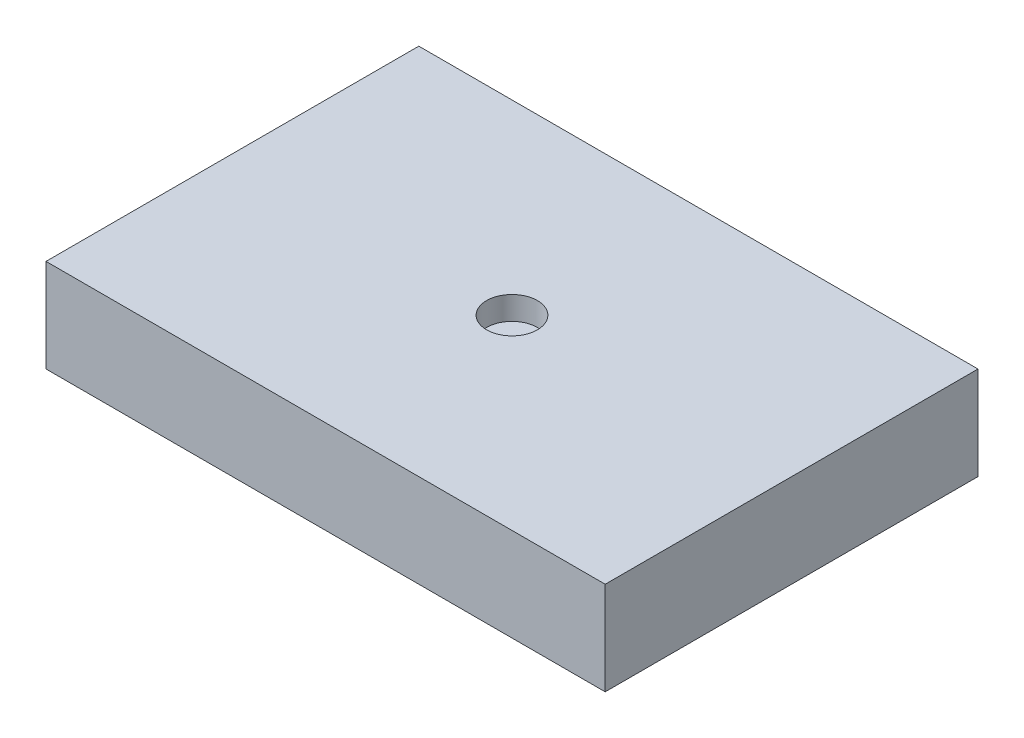
ISO-10303-21;
HEADER;
FILE_DESCRIPTION(('STEP AP214'),'2;1');
FILE_NAME('part.step','',(''),(''),'','','');
FILE_SCHEMA(('AUTOMOTIVE_DESIGN { 1 0 10303 214 1 1 1 1 }'));
ENDSEC;
DATA;
#1=APPLICATION_CONTEXT('core data for automotive mechanical design processes');
#2=APPLICATION_PROTOCOL_DEFINITION('international standard','automotive_design',2000,#1);
#3=PRODUCT_CONTEXT('',#1,'mechanical');
#4=PRODUCT('Part','Part','',(#3));
#5=PRODUCT_RELATED_PRODUCT_CATEGORY('part','',(#4));
#6=PRODUCT_DEFINITION_FORMATION('','',#4);
#7=PRODUCT_DEFINITION_CONTEXT('part definition',#1,'design');
#8=PRODUCT_DEFINITION('design','',#6,#7);
#9=PRODUCT_DEFINITION_SHAPE('','',#8);
#10=(LENGTH_UNIT() NAMED_UNIT(*) SI_UNIT(.MILLI.,.METRE.));
#11=(NAMED_UNIT(*) PLANE_ANGLE_UNIT() SI_UNIT($,.RADIAN.));
#12=(NAMED_UNIT(*) SI_UNIT($,.STERADIAN.) SOLID_ANGLE_UNIT());
#13=UNCERTAINTY_MEASURE_WITH_UNIT(LENGTH_MEASURE(1.E-05),#10,'distance_accuracy_value','');
#14=(GEOMETRIC_REPRESENTATION_CONTEXT(3) GLOBAL_UNCERTAINTY_ASSIGNED_CONTEXT((#13)) GLOBAL_UNIT_ASSIGNED_CONTEXT((#10,
#11,#12)) REPRESENTATION_CONTEXT('',''));
#15=CARTESIAN_POINT('',(0.,0.,0.));
#16=DIRECTION('',(0.,0.,1.));
#17=DIRECTION('',(1.,0.,0.));
#18=AXIS2_PLACEMENT_3D('',#15,#16,#17);
#19=CARTESIAN_POINT('',(15.24,5.08,10.16));
#20=DIRECTION('',(-1.,0.,0.));
#21=DIRECTION('',(0.,0.,1.));
#22=AXIS2_PLACEMENT_3D('',#19,#20,#21);
#23=PLANE('',#22);
#24=DIRECTION('',(0.,0.,-1.));
#25=VECTOR('',#24,1.);
#26=CARTESIAN_POINT('',(15.24,0.,10.16));
#27=LINE('',#26,#25);
#28=CARTESIAN_POINT('',(15.24,0.,10.16));
#29=VERTEX_POINT('',#28);
#30=CARTESIAN_POINT('',(15.24,0.,-10.16));
#31=VERTEX_POINT('',#30);
#32=EDGE_CURVE('E96',#29,#31,#27,.T.);
#33=ORIENTED_EDGE('',*,*,#32,.T.);
#34=DIRECTION('',(0.,-1.,0.));
#35=VECTOR('',#34,1.);
#36=CARTESIAN_POINT('',(15.24,5.08,-10.16));
#37=LINE('',#36,#35);
#38=CARTESIAN_POINT('',(15.24,5.08,-10.16));
#39=VERTEX_POINT('',#38);
#40=EDGE_CURVE('E11',#39,#31,#37,.T.);
#41=ORIENTED_EDGE('',*,*,#40,.F.);
#42=DIRECTION('',(0.,0.,-1.));
#43=VECTOR('',#42,1.);
#44=CARTESIAN_POINT('',(15.24,5.08,10.16));
#45=LINE('',#44,#43);
#46=CARTESIAN_POINT('',(15.24,5.08,10.16));
#47=VERTEX_POINT('',#46);
#48=EDGE_CURVE('E84',#47,#39,#45,.T.);
#49=ORIENTED_EDGE('',*,*,#48,.F.);
#50=DIRECTION('',(0.,-1.,0.));
#51=VECTOR('',#50,1.);
#52=CARTESIAN_POINT('',(15.24,5.08,10.16));
#53=LINE('',#52,#51);
#54=EDGE_CURVE('E92',#47,#29,#53,.T.);
#55=ORIENTED_EDGE('',*,*,#54,.T.);
#56=EDGE_LOOP('',(#33,#41,#49,#55));
#57=FACE_BOUND('',#56,.T.);
#58=ADVANCED_FACE('F33',(#57),#23,.F.);
#59=CARTESIAN_POINT('',(-15.24,5.08,-10.16));
#60=DIRECTION('',(0.,0.,1.));
#61=DIRECTION('',(1.,0.,0.));
#62=AXIS2_PLACEMENT_3D('',#59,#60,#61);
#63=PLANE('',#62);
#64=DIRECTION('',(-1.,0.,0.));
#65=VECTOR('',#64,1.);
#66=CARTESIAN_POINT('',(-15.24,0.,-10.16));
#67=LINE('',#66,#65);
#68=CARTESIAN_POINT('',(-15.24,0.,-10.16));
#69=VERTEX_POINT('',#68);
#70=EDGE_CURVE('E88',#31,#69,#67,.T.);
#71=ORIENTED_EDGE('',*,*,#70,.T.);
#72=DIRECTION('',(0.,-1.,0.));
#73=VECTOR('',#72,1.);
#74=CARTESIAN_POINT('',(-15.24,5.08,-10.16));
#75=LINE('',#74,#73);
#76=CARTESIAN_POINT('',(-15.24,5.08,-10.16));
#77=VERTEX_POINT('',#76);
#78=EDGE_CURVE('E41',#77,#69,#75,.T.);
#79=ORIENTED_EDGE('',*,*,#78,.F.);
#80=DIRECTION('',(-1.,0.,0.));
#81=VECTOR('',#80,1.);
#82=CARTESIAN_POINT('',(-15.24,5.08,-10.16));
#83=LINE('',#82,#81);
#84=EDGE_CURVE('E79',#39,#77,#83,.T.);
#85=ORIENTED_EDGE('',*,*,#84,.F.);
#86=ORIENTED_EDGE('',*,*,#40,.T.);
#87=EDGE_LOOP('',(#71,#79,#85,#86));
#88=FACE_BOUND('',#87,.T.);
#89=ADVANCED_FACE('F87',(#88),#63,.F.);
#90=CARTESIAN_POINT('',(-15.24,5.08,10.16));
#91=DIRECTION('',(1.,0.,0.));
#92=DIRECTION('',(0.,0.,-1.));
#93=AXIS2_PLACEMENT_3D('',#90,#91,#92);
#94=PLANE('',#93);
#95=DIRECTION('',(0.,0.,1.));
#96=VECTOR('',#95,1.);
#97=CARTESIAN_POINT('',(-15.24,0.,10.16));
#98=LINE('',#97,#96);
#99=CARTESIAN_POINT('',(-15.24,0.,10.16));
#100=VERTEX_POINT('',#99);
#101=EDGE_CURVE('E66',#69,#100,#98,.T.);
#102=ORIENTED_EDGE('',*,*,#101,.T.);
#103=DIRECTION('',(0.,-1.,0.));
#104=VECTOR('',#103,1.);
#105=CARTESIAN_POINT('',(-15.24,5.08,10.16));
#106=LINE('',#105,#104);
#107=CARTESIAN_POINT('',(-15.24,5.08,10.16));
#108=VERTEX_POINT('',#107);
#109=EDGE_CURVE('E89',#108,#100,#106,.T.);
#110=ORIENTED_EDGE('',*,*,#109,.F.);
#111=DIRECTION('',(0.,0.,1.));
#112=VECTOR('',#111,1.);
#113=CARTESIAN_POINT('',(-15.24,5.08,10.16));
#114=LINE('',#113,#112);
#115=EDGE_CURVE('E82',#77,#108,#114,.T.);
#116=ORIENTED_EDGE('',*,*,#115,.F.);
#117=ORIENTED_EDGE('',*,*,#78,.T.);
#118=EDGE_LOOP('',(#102,#110,#116,#117));
#119=FACE_BOUND('',#118,.T.);
#120=ADVANCED_FACE('F90',(#119),#94,.F.);
#121=CARTESIAN_POINT('',(-15.24,5.08,10.16));
#122=DIRECTION('',(0.,0.,-1.));
#123=DIRECTION('',(-1.,0.,0.));
#124=AXIS2_PLACEMENT_3D('',#121,#122,#123);
#125=PLANE('',#124);
#126=DIRECTION('',(1.,0.,0.));
#127=VECTOR('',#126,1.);
#128=CARTESIAN_POINT('',(-15.24,0.,10.16));
#129=LINE('',#128,#127);
#130=EDGE_CURVE('E72',#100,#29,#129,.T.);
#131=ORIENTED_EDGE('',*,*,#130,.T.);
#132=ORIENTED_EDGE('',*,*,#54,.F.);
#133=DIRECTION('',(1.,0.,0.));
#134=VECTOR('',#133,1.);
#135=CARTESIAN_POINT('',(-15.24,5.08,10.16));
#136=LINE('',#135,#134);
#137=EDGE_CURVE('E49',#108,#47,#136,.T.);
#138=ORIENTED_EDGE('',*,*,#137,.F.);
#139=ORIENTED_EDGE('',*,*,#109,.T.);
#140=EDGE_LOOP('',(#131,#132,#138,#139));
#141=FACE_BOUND('',#140,.T.);
#142=ADVANCED_FACE('F104',(#141),#125,.F.);
#143=CARTESIAN_POINT('',(0.,5.08,0.));
#144=DIRECTION('',(0.,-1.,0.));
#145=DIRECTION('',(0.,0.,-1.));
#146=AXIS2_PLACEMENT_3D('',#143,#144,#145);
#147=PLANE('',#146);
#148=CARTESIAN_POINT('',(0.,5.08,0.));
#149=DIRECTION('',(0.,1.,0.));
#150=DIRECTION('',(0.,0.,1.));
#151=AXIS2_PLACEMENT_3D('',#148,#149,#150);
#152=CIRCLE('',#151,1.38387439569011);
#153=CARTESIAN_POINT('',(0.,5.08,1.38387439569011));
#154=VERTEX_POINT('',#153);
#155=EDGE_CURVE('E110',#154,#154,#152,.T.);
#156=ORIENTED_EDGE('',*,*,#155,.F.);
#157=EDGE_LOOP('',(#156));
#158=FACE_BOUND('',#157,.T.);
#159=ORIENTED_EDGE('',*,*,#48,.T.);
#160=ORIENTED_EDGE('',*,*,#84,.T.);
#161=ORIENTED_EDGE('',*,*,#115,.T.);
#162=ORIENTED_EDGE('',*,*,#137,.T.);
#163=EDGE_LOOP('',(#159,#160,#161,#162));
#164=FACE_BOUND('',#163,.T.);
#165=ADVANCED_FACE('F80',(#158,#164),#147,.F.);
#166=CARTESIAN_POINT('',(0.,0.,0.));
#167=DIRECTION('',(0.,-1.,0.));
#168=DIRECTION('',(0.,0.,-1.));
#169=AXIS2_PLACEMENT_3D('',#166,#167,#168);
#170=PLANE('',#169);
#171=ORIENTED_EDGE('',*,*,#32,.F.);
#172=ORIENTED_EDGE('',*,*,#130,.F.);
#173=ORIENTED_EDGE('',*,*,#101,.F.);
#174=ORIENTED_EDGE('',*,*,#70,.F.);
#175=EDGE_LOOP('',(#171,#172,#173,#174));
#176=FACE_BOUND('',#175,.T.);
#177=ADVANCED_FACE('F107',(#176),#170,.T.);
#178=CARTESIAN_POINT('',(0.,3.81,0.));
#179=DIRECTION('',(0.,1.,0.));
#180=DIRECTION('',(0.,0.,1.));
#181=AXIS2_PLACEMENT_3D('',#178,#179,#180);
#182=CYLINDRICAL_SURFACE('',#181,1.38387439569011);
#183=CARTESIAN_POINT('',(0.,3.81,0.));
#184=DIRECTION('',(0.,1.,0.));
#185=DIRECTION('',(0.,0.,1.));
#186=AXIS2_PLACEMENT_3D('',#183,#184,#185);
#187=CIRCLE('',#186,1.38387439569011);
#188=CARTESIAN_POINT('',(0.,3.81,1.38387439569011));
#189=VERTEX_POINT('',#188);
#190=EDGE_CURVE('E99',#189,#189,#187,.T.);
#191=ORIENTED_EDGE('',*,*,#190,.F.);
#192=EDGE_LOOP('',(#191));
#193=FACE_BOUND('',#192,.T.);
#194=ORIENTED_EDGE('',*,*,#155,.T.);
#195=EDGE_LOOP('',(#194));
#196=FACE_BOUND('',#195,.T.);
#197=ADVANCED_FACE('F118',(#193,#196),#182,.F.);
#198=CARTESIAN_POINT('',(0.,3.81,0.));
#199=DIRECTION('',(0.,1.,0.));
#200=DIRECTION('',(0.,0.,1.));
#201=AXIS2_PLACEMENT_3D('',#198,#199,#200);
#202=PLANE('',#201);
#203=ORIENTED_EDGE('',*,*,#190,.T.);
#204=EDGE_LOOP('',(#203));
#205=FACE_BOUND('',#204,.T.);
#206=ADVANCED_FACE('F116',(#205),#202,.T.);
#207=CLOSED_SHELL('',(#58,#89,#120,#142,#165,#177,#197,#206));
#208=MANIFOLD_SOLID_BREP('B2',#207);
#209=ADVANCED_BREP_SHAPE_REPRESENTATION('',(#18,#208),#14);
#210=SHAPE_DEFINITION_REPRESENTATION(#9,#209);
ENDSEC;
END-ISO-10303-21;
